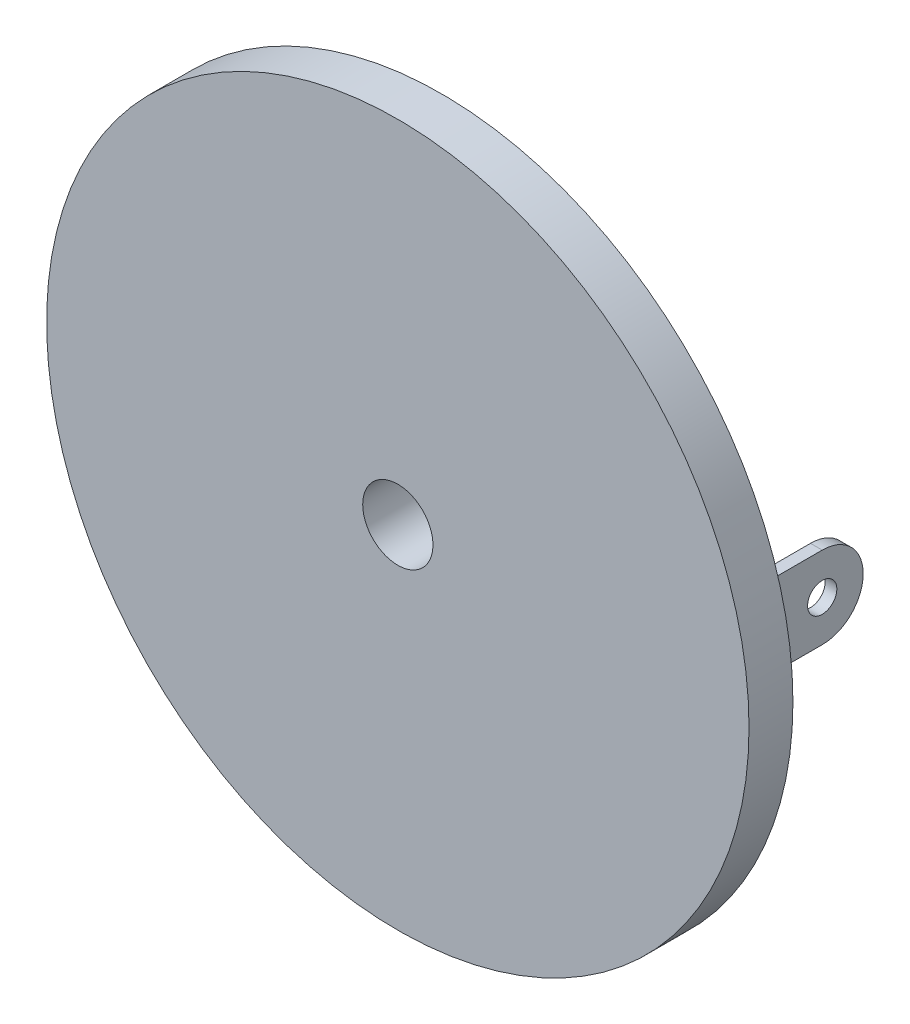
ISO-10303-21;
HEADER;
FILE_DESCRIPTION(('STEP AP214'),'2;1');
FILE_NAME('part.step','',(''),(''),'','','');
FILE_SCHEMA(('AUTOMOTIVE_DESIGN { 1 0 10303 214 1 1 1 1 }'));
ENDSEC;
DATA;
#1=APPLICATION_CONTEXT('core data for automotive mechanical design processes');
#2=APPLICATION_PROTOCOL_DEFINITION('international standard','automotive_design',2000,#1);
#3=PRODUCT_CONTEXT('',#1,'mechanical');
#4=PRODUCT('Part','Part','',(#3));
#5=PRODUCT_RELATED_PRODUCT_CATEGORY('part','',(#4));
#6=PRODUCT_DEFINITION_FORMATION('','',#4);
#7=PRODUCT_DEFINITION_CONTEXT('part definition',#1,'design');
#8=PRODUCT_DEFINITION('design','',#6,#7);
#9=PRODUCT_DEFINITION_SHAPE('','',#8);
#10=(LENGTH_UNIT() NAMED_UNIT(*) SI_UNIT(.MILLI.,.METRE.));
#11=(NAMED_UNIT(*) PLANE_ANGLE_UNIT() SI_UNIT($,.RADIAN.));
#12=(NAMED_UNIT(*) SI_UNIT($,.STERADIAN.) SOLID_ANGLE_UNIT());
#13=UNCERTAINTY_MEASURE_WITH_UNIT(LENGTH_MEASURE(1.E-05),#10,'distance_accuracy_value','');
#14=(GEOMETRIC_REPRESENTATION_CONTEXT(3) GLOBAL_UNCERTAINTY_ASSIGNED_CONTEXT((#13)) GLOBAL_UNIT_ASSIGNED_CONTEXT((#10,
#11,#12)) REPRESENTATION_CONTEXT('',''));
#15=CARTESIAN_POINT('',(0.,0.,0.));
#16=DIRECTION('',(0.,0.,1.));
#17=DIRECTION('',(1.,0.,0.));
#18=AXIS2_PLACEMENT_3D('',#15,#16,#17);
#19=CARTESIAN_POINT('',(0.,0.,0.));
#20=DIRECTION('',(0.,0.,1.));
#21=DIRECTION('',(1.,0.,0.));
#22=AXIS2_PLACEMENT_3D('',#19,#20,#21);
#23=PLANE('',#22);
#24=DIRECTION('',(0.,1.,0.));
#25=VECTOR('',#24,1.);
#26=CARTESIAN_POINT('',(-9.4,1.4,0.));
#27=LINE('',#26,#25);
#28=CARTESIAN_POINT('',(-9.4,-1.4,0.));
#29=VERTEX_POINT('',#28);
#30=CARTESIAN_POINT('',(-9.4,1.4,0.));
#31=VERTEX_POINT('',#30);
#32=EDGE_CURVE('E219',#29,#31,#27,.T.);
#33=ORIENTED_EDGE('',*,*,#32,.F.);
#34=DIRECTION('',(-1.,0.,0.));
#35=VECTOR('',#34,1.);
#36=CARTESIAN_POINT('',(-9.4,-1.4,0.));
#37=LINE('',#36,#35);
#38=CARTESIAN_POINT('',(-9.,-1.4,0.));
#39=VERTEX_POINT('',#38);
#40=EDGE_CURVE('E228',#39,#29,#37,.T.);
#41=ORIENTED_EDGE('',*,*,#40,.F.);
#42=DIRECTION('',(0.,-1.,0.));
#43=VECTOR('',#42,1.);
#44=CARTESIAN_POINT('',(-9.,1.4,0.));
#45=LINE('',#44,#43);
#46=CARTESIAN_POINT('',(-9.,1.4,0.));
#47=VERTEX_POINT('',#46);
#48=EDGE_CURVE('E225',#47,#39,#45,.T.);
#49=ORIENTED_EDGE('',*,*,#48,.F.);
#50=DIRECTION('',(1.,0.,0.));
#51=VECTOR('',#50,1.);
#52=CARTESIAN_POINT('',(-9.4,1.4,0.));
#53=LINE('',#52,#51);
#54=EDGE_CURVE('E222',#31,#47,#53,.T.);
#55=ORIENTED_EDGE('',*,*,#54,.F.);
#56=EDGE_LOOP('',(#33,#41,#49,#55));
#57=FACE_BOUND('',#56,.T.);
#58=CARTESIAN_POINT('',(0.,0.,0.));
#59=DIRECTION('',(0.,0.,1.));
#60=DIRECTION('',(1.,0.,0.));
#61=AXIS2_PLACEMENT_3D('',#58,#59,#60);
#62=CIRCLE('',#61,12.);
#63=CARTESIAN_POINT('',(12.,0.,0.));
#64=VERTEX_POINT('',#63);
#65=EDGE_CURVE('E120',#64,#64,#62,.T.);
#66=ORIENTED_EDGE('',*,*,#65,.F.);
#67=EDGE_LOOP('',(#66));
#68=FACE_BOUND('',#67,.T.);
#69=DIRECTION('',(0.,-1.,0.));
#70=VECTOR('',#69,1.);
#71=CARTESIAN_POINT('',(9.4,1.4,0.));
#72=LINE('',#71,#70);
#73=CARTESIAN_POINT('',(9.4,1.4,0.));
#74=VERTEX_POINT('',#73);
#75=CARTESIAN_POINT('',(9.4,-1.4,0.));
#76=VERTEX_POINT('',#75);
#77=EDGE_CURVE('E119',#74,#76,#72,.T.);
#78=ORIENTED_EDGE('',*,*,#77,.F.);
#79=DIRECTION('',(1.,0.,0.));
#80=VECTOR('',#79,1.);
#81=CARTESIAN_POINT('',(9.4,1.4,0.));
#82=LINE('',#81,#80);
#83=CARTESIAN_POINT('',(9.,1.4,0.));
#84=VERTEX_POINT('',#83);
#85=EDGE_CURVE('E245',#84,#74,#82,.T.);
#86=ORIENTED_EDGE('',*,*,#85,.F.);
#87=DIRECTION('',(0.,1.,0.));
#88=VECTOR('',#87,1.);
#89=CARTESIAN_POINT('',(9.,1.4,0.));
#90=LINE('',#89,#88);
#91=CARTESIAN_POINT('',(9.,-1.4,0.));
#92=VERTEX_POINT('',#91);
#93=EDGE_CURVE('E242',#92,#84,#90,.T.);
#94=ORIENTED_EDGE('',*,*,#93,.F.);
#95=DIRECTION('',(-1.,0.,0.));
#96=VECTOR('',#95,1.);
#97=CARTESIAN_POINT('',(9.4,-1.4,0.));
#98=LINE('',#97,#96);
#99=EDGE_CURVE('E240',#76,#92,#98,.T.);
#100=ORIENTED_EDGE('',*,*,#99,.F.);
#101=EDGE_LOOP('',(#78,#86,#94,#100));
#102=FACE_BOUND('',#101,.T.);
#103=CARTESIAN_POINT('',(0.,0.,0.));
#104=DIRECTION('',(0.,0.,1.));
#105=DIRECTION('',(1.,0.,0.));
#106=AXIS2_PLACEMENT_3D('',#103,#104,#105);
#107=CIRCLE('',#106,4.2);
#108=CARTESIAN_POINT('',(4.2,0.,0.));
#109=VERTEX_POINT('',#108);
#110=EDGE_CURVE('E11',#109,#109,#107,.F.);
#111=ORIENTED_EDGE('',*,*,#110,.F.);
#112=EDGE_LOOP('',(#111));
#113=FACE_BOUND('',#112,.T.);
#114=ADVANCED_FACE('F33',(#57,#68,#102,#113),#23,.F.);
#115=CARTESIAN_POINT('',(0.,0.,1.5));
#116=DIRECTION('',(0.,0.,-1.));
#117=DIRECTION('',(-1.,0.,0.));
#118=AXIS2_PLACEMENT_3D('',#115,#116,#117);
#119=CYLINDRICAL_SURFACE('',#118,12.);
#120=CARTESIAN_POINT('',(0.,0.,1.5));
#121=DIRECTION('',(0.,0.,1.));
#122=DIRECTION('',(1.,0.,0.));
#123=AXIS2_PLACEMENT_3D('',#120,#121,#122);
#124=CIRCLE('',#123,12.);
#125=CARTESIAN_POINT('',(12.,0.,1.5));
#126=VERTEX_POINT('',#125);
#127=EDGE_CURVE('E42',#126,#126,#124,.T.);
#128=ORIENTED_EDGE('',*,*,#127,.F.);
#129=EDGE_LOOP('',(#128));
#130=FACE_BOUND('',#129,.T.);
#131=ORIENTED_EDGE('',*,*,#65,.T.);
#132=EDGE_LOOP('',(#131));
#133=FACE_BOUND('',#132,.T.);
#134=ADVANCED_FACE('F35',(#130,#133),#119,.T.);
#135=CARTESIAN_POINT('',(0.,0.,1.5));
#136=DIRECTION('',(0.,0.,1.));
#137=DIRECTION('',(1.,0.,0.));
#138=AXIS2_PLACEMENT_3D('',#135,#136,#137);
#139=PLANE('',#138);
#140=CARTESIAN_POINT('',(0.,0.,1.5));
#141=DIRECTION('',(0.,0.,-1.));
#142=DIRECTION('',(-1.,0.,0.));
#143=AXIS2_PLACEMENT_3D('',#140,#141,#142);
#144=CIRCLE('',#143,1.2);
#145=CARTESIAN_POINT('',(-1.2,0.,1.5));
#146=VERTEX_POINT('',#145);
#147=EDGE_CURVE('E105',#146,#146,#144,.T.);
#148=ORIENTED_EDGE('',*,*,#147,.T.);
#149=EDGE_LOOP('',(#148));
#150=FACE_BOUND('',#149,.T.);
#151=ORIENTED_EDGE('',*,*,#127,.T.);
#152=EDGE_LOOP('',(#151));
#153=FACE_BOUND('',#152,.T.);
#154=ADVANCED_FACE('F131',(#150,#153),#139,.T.);
#155=CARTESIAN_POINT('',(9.4,1.4,-5.));
#156=DIRECTION('',(-1.,0.,0.));
#157=DIRECTION('',(0.,0.,1.));
#158=AXIS2_PLACEMENT_3D('',#155,#156,#157);
#159=PLANE('',#158);
#160=CARTESIAN_POINT('',(9.4,0.,-3.6));
#161=DIRECTION('',(1.,0.,0.));
#162=DIRECTION('',(0.,0.,-1.));
#163=AXIS2_PLACEMENT_3D('',#160,#161,#162);
#164=CIRCLE('',#163,0.500000000000001);
#165=CARTESIAN_POINT('',(9.4,0.,-4.1));
#166=VERTEX_POINT('',#165);
#167=EDGE_CURVE('E207',#166,#166,#164,.T.);
#168=ORIENTED_EDGE('',*,*,#167,.F.);
#169=EDGE_LOOP('',(#168));
#170=FACE_BOUND('',#169,.T.);
#171=DIRECTION('',(0.,0.,1.));
#172=VECTOR('',#171,1.);
#173=CARTESIAN_POINT('',(9.4,-1.4,-5.));
#174=LINE('',#173,#172);
#175=CARTESIAN_POINT('',(9.4,-1.4,-3.6));
#176=VERTEX_POINT('',#175);
#177=EDGE_CURVE('E111',#176,#76,#174,.T.);
#178=ORIENTED_EDGE('',*,*,#177,.F.);
#179=CARTESIAN_POINT('',(9.4,0.,-3.6));
#180=DIRECTION('',(-1.,0.,0.));
#181=DIRECTION('',(0.,0.,-1.));
#182=AXIS2_PLACEMENT_3D('',#179,#180,#181);
#183=CIRCLE('',#182,1.4);
#184=CARTESIAN_POINT('',(9.4,1.4,-3.6));
#185=VERTEX_POINT('',#184);
#186=EDGE_CURVE('E97',#185,#176,#183,.T.);
#187=ORIENTED_EDGE('',*,*,#186,.F.);
#188=DIRECTION('',(0.,0.,1.));
#189=VECTOR('',#188,1.);
#190=CARTESIAN_POINT('',(9.4,1.4,-5.));
#191=LINE('',#190,#189);
#192=EDGE_CURVE('E247',#185,#74,#191,.T.);
#193=ORIENTED_EDGE('',*,*,#192,.T.);
#194=ORIENTED_EDGE('',*,*,#77,.T.);
#195=EDGE_LOOP('',(#178,#187,#193,#194));
#196=FACE_BOUND('',#195,.T.);
#197=ADVANCED_FACE('F117',(#170,#196),#159,.F.);
#198=CARTESIAN_POINT('',(9.4,-1.4,-5.));
#199=DIRECTION('',(0.,1.,0.));
#200=DIRECTION('',(0.,0.,1.));
#201=AXIS2_PLACEMENT_3D('',#198,#199,#200);
#202=PLANE('',#201);
#203=DIRECTION('',(0.,0.,1.));
#204=VECTOR('',#203,1.);
#205=CARTESIAN_POINT('',(9.,-1.4,-5.));
#206=LINE('',#205,#204);
#207=CARTESIAN_POINT('',(9.,-1.4,-3.6));
#208=VERTEX_POINT('',#207);
#209=EDGE_CURVE('E113',#208,#92,#206,.T.);
#210=ORIENTED_EDGE('',*,*,#209,.F.);
#211=DIRECTION('',(1.,0.,0.));
#212=VECTOR('',#211,1.);
#213=CARTESIAN_POINT('',(-12.,-1.4,-3.6));
#214=LINE('',#213,#212);
#215=EDGE_CURVE('E100',#208,#176,#214,.T.);
#216=ORIENTED_EDGE('',*,*,#215,.T.);
#217=ORIENTED_EDGE('',*,*,#177,.T.);
#218=ORIENTED_EDGE('',*,*,#99,.T.);
#219=EDGE_LOOP('',(#210,#216,#217,#218));
#220=FACE_BOUND('',#219,.T.);
#221=ADVANCED_FACE('F109',(#220),#202,.F.);
#222=CARTESIAN_POINT('',(9.,1.4,-5.));
#223=DIRECTION('',(1.,0.,0.));
#224=DIRECTION('',(0.,0.,-1.));
#225=AXIS2_PLACEMENT_3D('',#222,#223,#224);
#226=PLANE('',#225);
#227=CARTESIAN_POINT('',(9.,0.,-3.6));
#228=DIRECTION('',(1.,0.,0.));
#229=DIRECTION('',(0.,0.,-1.));
#230=AXIS2_PLACEMENT_3D('',#227,#228,#229);
#231=CIRCLE('',#230,0.500000000000001);
#232=CARTESIAN_POINT('',(9.,0.,-4.1));
#233=VERTEX_POINT('',#232);
#234=EDGE_CURVE('E213',#233,#233,#231,.T.);
#235=ORIENTED_EDGE('',*,*,#234,.T.);
#236=EDGE_LOOP('',(#235));
#237=FACE_BOUND('',#236,.T.);
#238=DIRECTION('',(0.,0.,1.));
#239=VECTOR('',#238,1.);
#240=CARTESIAN_POINT('',(9.,1.4,-5.));
#241=LINE('',#240,#239);
#242=CARTESIAN_POINT('',(9.,1.4,-3.6));
#243=VERTEX_POINT('',#242);
#244=EDGE_CURVE('E124',#243,#84,#241,.T.);
#245=ORIENTED_EDGE('',*,*,#244,.F.);
#246=CARTESIAN_POINT('',(9.,0.,-3.6));
#247=DIRECTION('',(1.,0.,0.));
#248=DIRECTION('',(0.,0.,-1.));
#249=AXIS2_PLACEMENT_3D('',#246,#247,#248);
#250=CIRCLE('',#249,1.4);
#251=EDGE_CURVE('E49',#243,#208,#250,.F.);
#252=ORIENTED_EDGE('',*,*,#251,.T.);
#253=ORIENTED_EDGE('',*,*,#209,.T.);
#254=ORIENTED_EDGE('',*,*,#93,.T.);
#255=EDGE_LOOP('',(#245,#252,#253,#254));
#256=FACE_BOUND('',#255,.T.);
#257=ADVANCED_FACE('F179',(#237,#256),#226,.F.);
#258=CARTESIAN_POINT('',(9.4,1.4,-5.));
#259=DIRECTION('',(0.,-1.,0.));
#260=DIRECTION('',(0.,0.,-1.));
#261=AXIS2_PLACEMENT_3D('',#258,#259,#260);
#262=PLANE('',#261);
#263=ORIENTED_EDGE('',*,*,#192,.F.);
#264=DIRECTION('',(1.,0.,0.));
#265=VECTOR('',#264,1.);
#266=CARTESIAN_POINT('',(-12.,1.4,-3.6));
#267=LINE('',#266,#265);
#268=EDGE_CURVE('E101',#243,#185,#267,.T.);
#269=ORIENTED_EDGE('',*,*,#268,.F.);
#270=ORIENTED_EDGE('',*,*,#244,.T.);
#271=ORIENTED_EDGE('',*,*,#85,.T.);
#272=EDGE_LOOP('',(#263,#269,#270,#271));
#273=FACE_BOUND('',#272,.T.);
#274=ADVANCED_FACE('F175',(#273),#262,.F.);
#275=CARTESIAN_POINT('',(-9.4,1.4,-5.));
#276=DIRECTION('',(1.,0.,0.));
#277=DIRECTION('',(0.,0.,-1.));
#278=AXIS2_PLACEMENT_3D('',#275,#276,#277);
#279=PLANE('',#278);
#280=CARTESIAN_POINT('',(-9.4,0.,-3.6));
#281=DIRECTION('',(1.,0.,0.));
#282=DIRECTION('',(0.,0.,-1.));
#283=AXIS2_PLACEMENT_3D('',#280,#281,#282);
#284=CIRCLE('',#283,0.500000000000001);
#285=CARTESIAN_POINT('',(-9.4,0.,-4.1));
#286=VERTEX_POINT('',#285);
#287=EDGE_CURVE('E210',#286,#286,#284,.T.);
#288=ORIENTED_EDGE('',*,*,#287,.T.);
#289=EDGE_LOOP('',(#288));
#290=FACE_BOUND('',#289,.T.);
#291=DIRECTION('',(0.,0.,1.));
#292=VECTOR('',#291,1.);
#293=CARTESIAN_POINT('',(-9.4,1.4,-5.));
#294=LINE('',#293,#292);
#295=CARTESIAN_POINT('',(-9.4,1.4,-3.6));
#296=VERTEX_POINT('',#295);
#297=EDGE_CURVE('E237',#296,#31,#294,.T.);
#298=ORIENTED_EDGE('',*,*,#297,.F.);
#299=CARTESIAN_POINT('',(-9.4,0.,-3.6));
#300=DIRECTION('',(1.,0.,0.));
#301=DIRECTION('',(0.,0.,-1.));
#302=AXIS2_PLACEMENT_3D('',#299,#300,#301);
#303=CIRCLE('',#302,1.4);
#304=CARTESIAN_POINT('',(-9.4,-1.4,-3.6));
#305=VERTEX_POINT('',#304);
#306=EDGE_CURVE('E203',#296,#305,#303,.F.);
#307=ORIENTED_EDGE('',*,*,#306,.T.);
#308=DIRECTION('',(0.,0.,1.));
#309=VECTOR('',#308,1.);
#310=CARTESIAN_POINT('',(-9.4,-1.4,-5.));
#311=LINE('',#310,#309);
#312=EDGE_CURVE('E231',#305,#29,#311,.T.);
#313=ORIENTED_EDGE('',*,*,#312,.T.);
#314=ORIENTED_EDGE('',*,*,#32,.T.);
#315=EDGE_LOOP('',(#298,#307,#313,#314));
#316=FACE_BOUND('',#315,.T.);
#317=ADVANCED_FACE('F171',(#290,#316),#279,.F.);
#318=CARTESIAN_POINT('',(-9.4,1.4,-5.));
#319=DIRECTION('',(0.,-1.,0.));
#320=DIRECTION('',(0.,0.,-1.));
#321=AXIS2_PLACEMENT_3D('',#318,#319,#320);
#322=PLANE('',#321);
#323=DIRECTION('',(0.,0.,1.));
#324=VECTOR('',#323,1.);
#325=CARTESIAN_POINT('',(-9.,1.4,-5.));
#326=LINE('',#325,#324);
#327=CARTESIAN_POINT('',(-9.,1.4,-3.6));
#328=VERTEX_POINT('',#327);
#329=EDGE_CURVE('E235',#328,#47,#326,.T.);
#330=ORIENTED_EDGE('',*,*,#329,.F.);
#331=EDGE_CURVE('E200',#296,#328,#267,.T.);
#332=ORIENTED_EDGE('',*,*,#331,.F.);
#333=ORIENTED_EDGE('',*,*,#297,.T.);
#334=ORIENTED_EDGE('',*,*,#54,.T.);
#335=EDGE_LOOP('',(#330,#332,#333,#334));
#336=FACE_BOUND('',#335,.T.);
#337=ADVANCED_FACE('F167',(#336),#322,.F.);
#338=CARTESIAN_POINT('',(-9.,1.4,-5.));
#339=DIRECTION('',(-1.,0.,0.));
#340=DIRECTION('',(0.,0.,1.));
#341=AXIS2_PLACEMENT_3D('',#338,#339,#340);
#342=PLANE('',#341);
#343=CARTESIAN_POINT('',(-9.,0.,-3.6));
#344=DIRECTION('',(-1.,0.,0.));
#345=DIRECTION('',(0.,0.,1.));
#346=AXIS2_PLACEMENT_3D('',#343,#344,#345);
#347=CIRCLE('',#346,0.500000000000001);
#348=CARTESIAN_POINT('',(-9.,0.,-3.1));
#349=VERTEX_POINT('',#348);
#350=EDGE_CURVE('E37',#349,#349,#347,.T.);
#351=ORIENTED_EDGE('',*,*,#350,.T.);
#352=EDGE_LOOP('',(#351));
#353=FACE_BOUND('',#352,.T.);
#354=DIRECTION('',(0.,0.,1.));
#355=VECTOR('',#354,1.);
#356=CARTESIAN_POINT('',(-9.,-1.4,-5.));
#357=LINE('',#356,#355);
#358=CARTESIAN_POINT('',(-9.,-1.4,-3.6));
#359=VERTEX_POINT('',#358);
#360=EDGE_CURVE('E233',#359,#39,#357,.T.);
#361=ORIENTED_EDGE('',*,*,#360,.F.);
#362=CARTESIAN_POINT('',(-9.,0.,-3.6));
#363=DIRECTION('',(-1.,0.,0.));
#364=DIRECTION('',(0.,0.,1.));
#365=AXIS2_PLACEMENT_3D('',#362,#363,#364);
#366=CIRCLE('',#365,1.4);
#367=EDGE_CURVE('E57',#359,#328,#366,.F.);
#368=ORIENTED_EDGE('',*,*,#367,.T.);
#369=ORIENTED_EDGE('',*,*,#329,.T.);
#370=ORIENTED_EDGE('',*,*,#48,.T.);
#371=EDGE_LOOP('',(#361,#368,#369,#370));
#372=FACE_BOUND('',#371,.T.);
#373=ADVANCED_FACE('F159',(#353,#372),#342,.F.);
#374=CARTESIAN_POINT('',(-9.4,-1.4,-5.));
#375=DIRECTION('',(0.,1.,0.));
#376=DIRECTION('',(0.,0.,1.));
#377=AXIS2_PLACEMENT_3D('',#374,#375,#376);
#378=PLANE('',#377);
#379=ORIENTED_EDGE('',*,*,#312,.F.);
#380=EDGE_CURVE('E114',#305,#359,#214,.T.);
#381=ORIENTED_EDGE('',*,*,#380,.T.);
#382=ORIENTED_EDGE('',*,*,#360,.T.);
#383=ORIENTED_EDGE('',*,*,#40,.T.);
#384=EDGE_LOOP('',(#379,#381,#382,#383));
#385=FACE_BOUND('',#384,.T.);
#386=ADVANCED_FACE('F149',(#385),#378,.F.);
#387=CARTESIAN_POINT('',(0.,0.,-2.));
#388=DIRECTION('',(0.,0.,1.));
#389=DIRECTION('',(1.,0.,0.));
#390=AXIS2_PLACEMENT_3D('',#387,#388,#389);
#391=CYLINDRICAL_SURFACE('',#390,4.2);
#392=CARTESIAN_POINT('',(0.,0.,-2.));
#393=DIRECTION('',(0.,0.,-1.));
#394=DIRECTION('',(-1.,0.,0.));
#395=AXIS2_PLACEMENT_3D('',#392,#393,#394);
#396=CIRCLE('',#395,4.2);
#397=CARTESIAN_POINT('',(-4.2,0.,-2.));
#398=VERTEX_POINT('',#397);
#399=EDGE_CURVE('E216',#398,#398,#396,.T.);
#400=ORIENTED_EDGE('',*,*,#399,.F.);
#401=EDGE_LOOP('',(#400));
#402=FACE_BOUND('',#401,.T.);
#403=ORIENTED_EDGE('',*,*,#110,.T.);
#404=EDGE_LOOP('',(#403));
#405=FACE_BOUND('',#404,.T.);
#406=ADVANCED_FACE('F146',(#402,#405),#391,.T.);
#407=CARTESIAN_POINT('',(0.,0.,-2.));
#408=DIRECTION('',(0.,0.,-1.));
#409=DIRECTION('',(-1.,0.,0.));
#410=AXIS2_PLACEMENT_3D('',#407,#408,#409);
#411=PLANE('',#410);
#412=CARTESIAN_POINT('',(0.,0.,-2.));
#413=DIRECTION('',(0.,0.,-1.));
#414=DIRECTION('',(-1.,0.,0.));
#415=AXIS2_PLACEMENT_3D('',#412,#413,#414);
#416=CIRCLE('',#415,1.2);
#417=CARTESIAN_POINT('',(-1.2,0.,-2.));
#418=VERTEX_POINT('',#417);
#419=EDGE_CURVE('E195',#418,#418,#416,.T.);
#420=ORIENTED_EDGE('',*,*,#419,.F.);
#421=EDGE_LOOP('',(#420));
#422=FACE_BOUND('',#421,.T.);
#423=ORIENTED_EDGE('',*,*,#399,.T.);
#424=EDGE_LOOP('',(#423));
#425=FACE_BOUND('',#424,.T.);
#426=ADVANCED_FACE('F148',(#422,#425),#411,.T.);
#427=CARTESIAN_POINT('',(-12.,0.,-3.6));
#428=DIRECTION('',(1.,0.,0.));
#429=DIRECTION('',(0.,0.,-1.));
#430=AXIS2_PLACEMENT_3D('',#427,#428,#429);
#431=CYLINDRICAL_SURFACE('',#430,0.500000000000001);
#432=ORIENTED_EDGE('',*,*,#350,.F.);
#433=EDGE_LOOP('',(#432));
#434=FACE_BOUND('',#433,.T.);
#435=ORIENTED_EDGE('',*,*,#287,.F.);
#436=EDGE_LOOP('',(#435));
#437=FACE_BOUND('',#436,.T.);
#438=ADVANCED_FACE('F156',(#434,#437),#431,.F.);
#439=ORIENTED_EDGE('',*,*,#167,.T.);
#440=EDGE_LOOP('',(#439));
#441=FACE_BOUND('',#440,.T.);
#442=ORIENTED_EDGE('',*,*,#234,.F.);
#443=EDGE_LOOP('',(#442));
#444=FACE_BOUND('',#443,.T.);
#445=ADVANCED_FACE('F264',(#441,#444),#431,.F.);
#446=CARTESIAN_POINT('',(-12.,0.,-3.6));
#447=DIRECTION('',(1.,0.,0.));
#448=DIRECTION('',(0.,0.,-1.));
#449=AXIS2_PLACEMENT_3D('',#446,#447,#448);
#450=CYLINDRICAL_SURFACE('',#449,1.4);
#451=ORIENTED_EDGE('',*,*,#306,.F.);
#452=ORIENTED_EDGE('',*,*,#331,.T.);
#453=ORIENTED_EDGE('',*,*,#367,.F.);
#454=ORIENTED_EDGE('',*,*,#380,.F.);
#455=EDGE_LOOP('',(#451,#452,#453,#454));
#456=FACE_BOUND('',#455,.T.);
#457=ADVANCED_FACE('F262',(#456),#450,.T.);
#458=ORIENTED_EDGE('',*,*,#251,.F.);
#459=ORIENTED_EDGE('',*,*,#268,.T.);
#460=ORIENTED_EDGE('',*,*,#186,.T.);
#461=ORIENTED_EDGE('',*,*,#215,.F.);
#462=EDGE_LOOP('',(#458,#459,#460,#461));
#463=FACE_BOUND('',#462,.T.);
#464=ADVANCED_FACE('F99',(#463),#450,.T.);
#465=CARTESIAN_POINT('',(0.,0.,1.5));
#466=DIRECTION('',(0.,0.,-1.));
#467=DIRECTION('',(-1.,0.,0.));
#468=AXIS2_PLACEMENT_3D('',#465,#466,#467);
#469=CYLINDRICAL_SURFACE('',#468,1.2);
#470=ORIENTED_EDGE('',*,*,#147,.F.);
#471=EDGE_LOOP('',(#470));
#472=FACE_BOUND('',#471,.T.);
#473=ORIENTED_EDGE('',*,*,#419,.T.);
#474=EDGE_LOOP('',(#473));
#475=FACE_BOUND('',#474,.T.);
#476=ADVANCED_FACE('F270',(#472,#475),#469,.F.);
#477=CLOSED_SHELL('',(#114,#134,#154,#197,#221,#257,#274,#317,#337,#373,#386,#406,#426,#438,
#445,#457,#464,#476));
#478=MANIFOLD_SOLID_BREP('B2',#477);
#479=ADVANCED_BREP_SHAPE_REPRESENTATION('',(#18,#478),#14);
#480=SHAPE_DEFINITION_REPRESENTATION(#9,#479);
ENDSEC;
END-ISO-10303-21;
